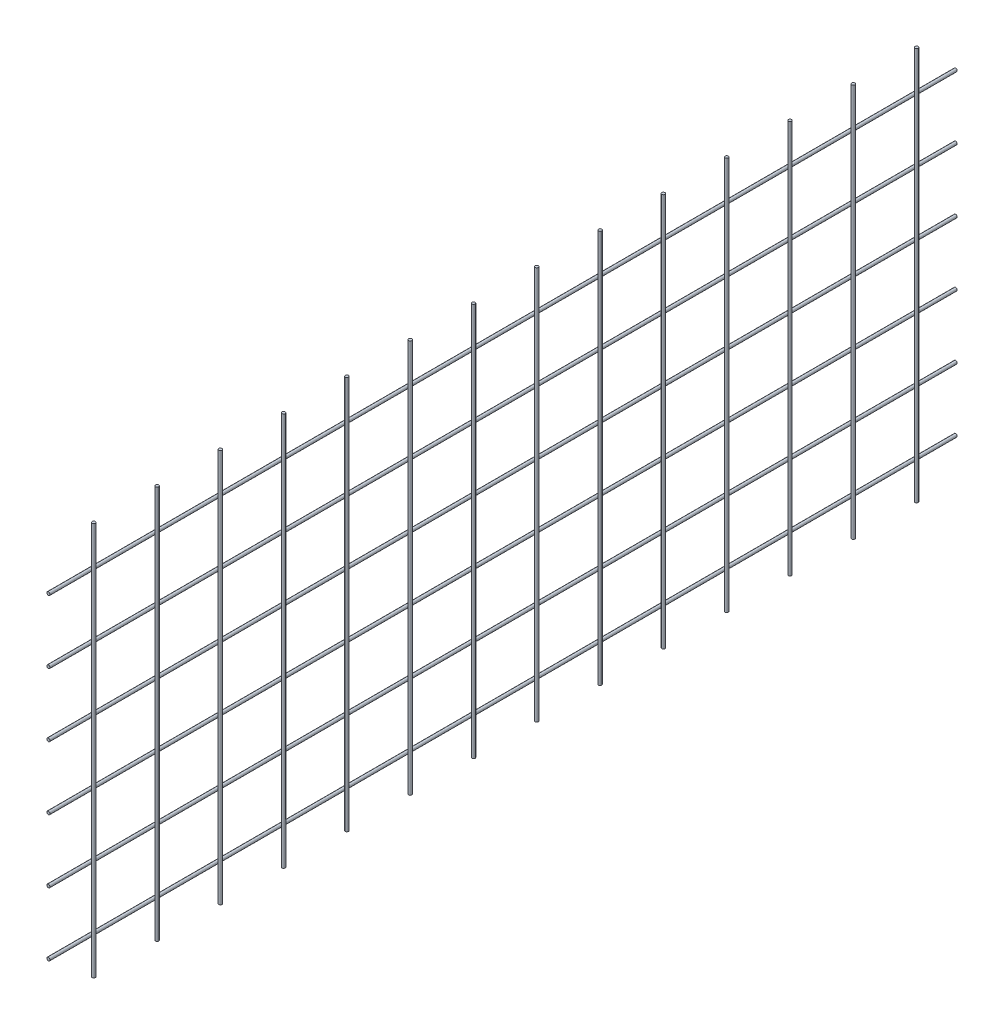
ISO-10303-21;
HEADER;
FILE_DESCRIPTION(('STEP AP214'),'2;1');
FILE_NAME('part.step','',(''),(''),'','','');
FILE_SCHEMA(('AUTOMOTIVE_DESIGN { 1 0 10303 214 1 1 1 1 }'));
ENDSEC;
DATA;
#1=APPLICATION_CONTEXT('core data for automotive mechanical design processes');
#2=APPLICATION_PROTOCOL_DEFINITION('international standard','automotive_design',2000,#1);
#3=PRODUCT_CONTEXT('',#1,'mechanical');
#4=PRODUCT('Part','Part','',(#3));
#5=PRODUCT_RELATED_PRODUCT_CATEGORY('part','',(#4));
#6=PRODUCT_DEFINITION_FORMATION('','',#4);
#7=PRODUCT_DEFINITION_CONTEXT('part definition',#1,'design');
#8=PRODUCT_DEFINITION('design','',#6,#7);
#9=PRODUCT_DEFINITION_SHAPE('','',#8);
#10=(LENGTH_UNIT() NAMED_UNIT(*) SI_UNIT(.MILLI.,.METRE.));
#11=(NAMED_UNIT(*) PLANE_ANGLE_UNIT() SI_UNIT($,.RADIAN.));
#12=(NAMED_UNIT(*) SI_UNIT($,.STERADIAN.) SOLID_ANGLE_UNIT());
#13=UNCERTAINTY_MEASURE_WITH_UNIT(LENGTH_MEASURE(1.E-05),#10,'distance_accuracy_value','');
#14=(GEOMETRIC_REPRESENTATION_CONTEXT(3) GLOBAL_UNCERTAINTY_ASSIGNED_CONTEXT((#13)) GLOBAL_UNIT_ASSIGNED_CONTEXT((#10,
#11,#12)) REPRESENTATION_CONTEXT('',''));
#15=CARTESIAN_POINT('',(0.,0.,0.));
#16=DIRECTION('',(0.,0.,1.));
#17=DIRECTION('',(1.,0.,0.));
#18=AXIS2_PLACEMENT_3D('',#15,#16,#17);
#19=CARTESIAN_POINT('',(3.00000000000011,1980.00200000001,-300.000000000003));
#20=DIRECTION('',(0.,-1.00000000000001,0.));
#21=DIRECTION('',(0.,0.,-1.));
#22=AXIS2_PLACEMENT_3D('',#19,#20,#21);
#23=CYLINDRICAL_SURFACE('',#22,1.5);
#24=CARTESIAN_POINT('',(3.00000000000034,1940.00000000001,-300.000000000003));
#25=DIRECTION('',(0.,1.00000000000001,0.));
#26=DIRECTION('',(0.,0.,1.));
#27=AXIS2_PLACEMENT_3D('',#24,#25,#26);
#28=CIRCLE('',#27,1.5);
#29=CARTESIAN_POINT('',(3.00000000000033,1940.00000000001,-298.500000000003));
#30=VERTEX_POINT('',#29);
#31=EDGE_CURVE('E11',#30,#30,#28,.T.);
#32=ORIENTED_EDGE('',*,*,#31,.F.);
#33=EDGE_LOOP('',(#32));
#34=FACE_BOUND('',#33,.T.);
#35=CARTESIAN_POINT('',(3.00000000000011,1567.00000000001,-300.000000000003));
#36=DIRECTION('',(0.,-1.00000000000001,0.));
#37=DIRECTION('',(0.,0.,-1.));
#38=AXIS2_PLACEMENT_3D('',#35,#36,#37);
#39=CIRCLE('',#38,1.5);
#40=CARTESIAN_POINT('',(3.00000000000011,1567.00000000001,-301.500000000003));
#41=VERTEX_POINT('',#40);
#42=EDGE_CURVE('E59',#41,#41,#39,.T.);
#43=ORIENTED_EDGE('',*,*,#42,.F.);
#44=EDGE_LOOP('',(#43));
#45=FACE_BOUND('',#44,.T.);
#46=ADVANCED_FACE('F56',(#34,#45),#23,.T.);
#47=CARTESIAN_POINT('',(-15.4999999999981,1940.00000000002,-3060.00000000001));
#48=DIRECTION('',(0.,1.00000000000001,0.));
#49=DIRECTION('',(0.,0.,1.));
#50=AXIS2_PLACEMENT_3D('',#47,#48,#49);
#51=PLANE('',#50);
#52=ORIENTED_EDGE('',*,*,#31,.T.);
#53=EDGE_LOOP('',(#52));
#54=FACE_BOUND('',#53,.T.);
#55=ADVANCED_FACE('F76',(#54),#51,.T.);
#56=CARTESIAN_POINT('',(-20.0099999999999,1567.00000000001,-20.0000000000029));
#57=DIRECTION('',(0.,-1.00000000000001,0.));
#58=DIRECTION('',(0.,0.,-1.));
#59=AXIS2_PLACEMENT_3D('',#56,#57,#58);
#60=PLANE('',#59);
#61=ORIENTED_EDGE('',*,*,#42,.T.);
#62=EDGE_LOOP('',(#61));
#63=FACE_BOUND('',#62,.T.);
#64=ADVANCED_FACE('F73',(#63),#60,.T.);
#65=CLOSED_SHELL('',(#46,#55,#64));
#66=MANIFOLD_SOLID_BREP('B2',#65);
#67=CARTESIAN_POINT('',(-1.77635683940025E-12,1600.00000000001,-20.0000000000029));
#68=DIRECTION('',(0.,0.,-1.));
#69=DIRECTION('',(-0.999999999999997,0.,0.));
#70=AXIS2_PLACEMENT_3D('',#67,#68,#69);
#71=PLANE('',#70);
#72=CARTESIAN_POINT('',(-1.77635683940025E-12,1600.00000000001,-20.0000000000029));
#73=DIRECTION('',(0.,0.,-1.));
#74=DIRECTION('',(-0.999999999999997,0.,0.));
#75=AXIS2_PLACEMENT_3D('',#72,#73,#74);
#76=CIRCLE('',#75,1.49999999999989);
#77=CARTESIAN_POINT('',(-1.50000000000166,1600.00000000001,-20.0000000000029));
#78=VERTEX_POINT('',#77);
#79=EDGE_CURVE('E55',#78,#78,#76,.T.);
#80=ORIENTED_EDGE('',*,*,#79,.F.);
#81=EDGE_LOOP('',(#80));
#82=FACE_BOUND('',#81,.T.);
#83=ADVANCED_FACE('F104',(#82),#71,.F.);
#84=CARTESIAN_POINT('',(-2.22044604925031E-13,1600.00000000002,-3080.00200000001));
#85=DIRECTION('',(0.,0.,1.));
#86=DIRECTION('',(0.999999999999997,0.,0.));
#87=AXIS2_PLACEMENT_3D('',#84,#85,#86);
#88=CYLINDRICAL_SURFACE('',#87,1.49999999999989);
#89=ORIENTED_EDGE('',*,*,#79,.T.);
#90=EDGE_LOOP('',(#89));
#91=FACE_BOUND('',#90,.T.);
#92=CARTESIAN_POINT('',(0.,1600.00000000001,-880.000000000004));
#93=DIRECTION('',(0.,0.,-1.));
#94=DIRECTION('',(-0.999999999999997,0.,0.));
#95=AXIS2_PLACEMENT_3D('',#92,#93,#94);
#96=CIRCLE('',#95,1.49999999999989);
#97=CARTESIAN_POINT('',(-1.49999999999988,1600.00000000001,-880.000000000004));
#98=VERTEX_POINT('',#97);
#99=EDGE_CURVE('E108',#98,#98,#96,.T.);
#100=ORIENTED_EDGE('',*,*,#99,.F.);
#101=EDGE_LOOP('',(#100));
#102=FACE_BOUND('',#101,.T.);
#103=ADVANCED_FACE('F106',(#91,#102),#88,.T.);
#104=CARTESIAN_POINT('',(-20.0099999999979,1940.00000000001,-880.000000000004));
#105=DIRECTION('',(0.,0.,-1.));
#106=DIRECTION('',(-0.999999999999997,0.,0.));
#107=AXIS2_PLACEMENT_3D('',#104,#105,#106);
#108=PLANE('',#107);
#109=ORIENTED_EDGE('',*,*,#99,.T.);
#110=EDGE_LOOP('',(#109));
#111=FACE_BOUND('',#110,.T.);
#112=ADVANCED_FACE('F121',(#111),#108,.T.);
#113=CLOSED_SHELL('',(#83,#103,#112));
#114=MANIFOLD_SOLID_BREP('B6',#113);
#115=CARTESIAN_POINT('',(-1.77635683940025E-12,1660.00000000001,-20.0000000000029));
#116=DIRECTION('',(0.,0.,-1.));
#117=DIRECTION('',(-0.999999999999997,0.,0.));
#118=AXIS2_PLACEMENT_3D('',#115,#116,#117);
#119=PLANE('',#118);
#120=CARTESIAN_POINT('',(-1.77635683940025E-12,1660.00000000001,-20.0000000000029));
#121=DIRECTION('',(0.,0.,-1.));
#122=DIRECTION('',(-0.999999999999997,0.,0.));
#123=AXIS2_PLACEMENT_3D('',#120,#121,#122);
#124=CIRCLE('',#123,1.49999999999989);
#125=CARTESIAN_POINT('',(-1.50000000000166,1660.00000000001,-20.0000000000029));
#126=VERTEX_POINT('',#125);
#127=EDGE_CURVE('E103',#126,#126,#124,.T.);
#128=ORIENTED_EDGE('',*,*,#127,.F.);
#129=EDGE_LOOP('',(#128));
#130=FACE_BOUND('',#129,.T.);
#131=ADVANCED_FACE('F151',(#130),#119,.F.);
#132=CARTESIAN_POINT('',(-2.22044604925031E-13,1660.00000000002,-3080.00200000001));
#133=DIRECTION('',(0.,0.,1.));
#134=DIRECTION('',(0.999999999999997,0.,0.));
#135=AXIS2_PLACEMENT_3D('',#132,#133,#134);
#136=CYLINDRICAL_SURFACE('',#135,1.49999999999989);
#137=ORIENTED_EDGE('',*,*,#127,.T.);
#138=EDGE_LOOP('',(#137));
#139=FACE_BOUND('',#138,.T.);
#140=CARTESIAN_POINT('',(0.,1660.00000000001,-880.000000000004));
#141=DIRECTION('',(0.,0.,-1.));
#142=DIRECTION('',(-0.999999999999997,0.,0.));
#143=AXIS2_PLACEMENT_3D('',#140,#141,#142);
#144=CIRCLE('',#143,1.49999999999989);
#145=CARTESIAN_POINT('',(-1.49999999999988,1660.00000000001,-880.000000000004));
#146=VERTEX_POINT('',#145);
#147=EDGE_CURVE('E155',#146,#146,#144,.T.);
#148=ORIENTED_EDGE('',*,*,#147,.F.);
#149=EDGE_LOOP('',(#148));
#150=FACE_BOUND('',#149,.T.);
#151=ADVANCED_FACE('F153',(#139,#150),#136,.T.);
#152=CARTESIAN_POINT('',(-20.0099999999979,1940.00000000001,-880.000000000004));
#153=DIRECTION('',(0.,0.,-1.));
#154=DIRECTION('',(-0.999999999999997,0.,0.));
#155=AXIS2_PLACEMENT_3D('',#152,#153,#154);
#156=PLANE('',#155);
#157=ORIENTED_EDGE('',*,*,#147,.T.);
#158=EDGE_LOOP('',(#157));
#159=FACE_BOUND('',#158,.T.);
#160=ADVANCED_FACE('F168',(#159),#156,.T.);
#161=CLOSED_SHELL('',(#131,#151,#160));
#162=MANIFOLD_SOLID_BREP('B50',#161);
#163=CARTESIAN_POINT('',(2.22044604925031E-13,1720.00000000001,-20.0000000000029));
#164=DIRECTION('',(0.,0.,-1.));
#165=DIRECTION('',(-0.999999999999997,0.,0.));
#166=AXIS2_PLACEMENT_3D('',#163,#164,#165);
#167=PLANE('',#166);
#168=CARTESIAN_POINT('',(2.22044604925031E-13,1720.00000000001,-20.0000000000029));
#169=DIRECTION('',(0.,0.,-1.));
#170=DIRECTION('',(-0.999999999999997,0.,0.));
#171=AXIS2_PLACEMENT_3D('',#168,#169,#170);
#172=CIRCLE('',#171,1.49999999999989);
#173=CARTESIAN_POINT('',(-1.49999999999966,1720.00000000001,-20.0000000000029));
#174=VERTEX_POINT('',#173);
#175=EDGE_CURVE('E150',#174,#174,#172,.T.);
#176=ORIENTED_EDGE('',*,*,#175,.F.);
#177=EDGE_LOOP('',(#176));
#178=FACE_BOUND('',#177,.T.);
#179=ADVANCED_FACE('F198',(#178),#167,.F.);
#180=CARTESIAN_POINT('',(-2.22044604925031E-13,1720.00000000002,-3080.00200000001));
#181=DIRECTION('',(0.,0.,1.));
#182=DIRECTION('',(0.999999999999997,0.,0.));
#183=AXIS2_PLACEMENT_3D('',#180,#181,#182);
#184=CYLINDRICAL_SURFACE('',#183,1.49999999999989);
#185=ORIENTED_EDGE('',*,*,#175,.T.);
#186=EDGE_LOOP('',(#185));
#187=FACE_BOUND('',#186,.T.);
#188=CARTESIAN_POINT('',(0.,1720.00000000001,-880.000000000004));
#189=DIRECTION('',(0.,0.,-1.));
#190=DIRECTION('',(-0.999999999999997,0.,0.));
#191=AXIS2_PLACEMENT_3D('',#188,#189,#190);
#192=CIRCLE('',#191,1.49999999999989);
#193=CARTESIAN_POINT('',(-1.49999999999988,1720.00000000001,-880.000000000004));
#194=VERTEX_POINT('',#193);
#195=EDGE_CURVE('E202',#194,#194,#192,.T.);
#196=ORIENTED_EDGE('',*,*,#195,.F.);
#197=EDGE_LOOP('',(#196));
#198=FACE_BOUND('',#197,.T.);
#199=ADVANCED_FACE('F200',(#187,#198),#184,.T.);
#200=CARTESIAN_POINT('',(-20.0099999999979,1940.00000000001,-880.000000000004));
#201=DIRECTION('',(0.,0.,-1.));
#202=DIRECTION('',(-0.999999999999997,0.,0.));
#203=AXIS2_PLACEMENT_3D('',#200,#201,#202);
#204=PLANE('',#203);
#205=ORIENTED_EDGE('',*,*,#195,.T.);
#206=EDGE_LOOP('',(#205));
#207=FACE_BOUND('',#206,.T.);
#208=ADVANCED_FACE('F215',(#207),#204,.T.);
#209=CLOSED_SHELL('',(#179,#199,#208));
#210=MANIFOLD_SOLID_BREP('B98',#209);
#211=CARTESIAN_POINT('',(2.22044604925031E-13,1780.00000000001,-20.0000000000029));
#212=DIRECTION('',(0.,0.,-1.));
#213=DIRECTION('',(-0.999999999999997,0.,0.));
#214=AXIS2_PLACEMENT_3D('',#211,#212,#213);
#215=PLANE('',#214);
#216=CARTESIAN_POINT('',(2.22044604925031E-13,1780.00000000001,-20.0000000000029));
#217=DIRECTION('',(0.,0.,-1.));
#218=DIRECTION('',(-0.999999999999997,0.,0.));
#219=AXIS2_PLACEMENT_3D('',#216,#217,#218);
#220=CIRCLE('',#219,1.49999999999989);
#221=CARTESIAN_POINT('',(-1.49999999999966,1780.00000000001,-20.0000000000029));
#222=VERTEX_POINT('',#221);
#223=EDGE_CURVE('E197',#222,#222,#220,.T.);
#224=ORIENTED_EDGE('',*,*,#223,.F.);
#225=EDGE_LOOP('',(#224));
#226=FACE_BOUND('',#225,.T.);
#227=ADVANCED_FACE('F245',(#226),#215,.F.);
#228=CARTESIAN_POINT('',(-2.22044604925031E-13,1780.00000000002,-3080.00200000001));
#229=DIRECTION('',(0.,0.,1.));
#230=DIRECTION('',(0.999999999999997,0.,0.));
#231=AXIS2_PLACEMENT_3D('',#228,#229,#230);
#232=CYLINDRICAL_SURFACE('',#231,1.49999999999989);
#233=ORIENTED_EDGE('',*,*,#223,.T.);
#234=EDGE_LOOP('',(#233));
#235=FACE_BOUND('',#234,.T.);
#236=CARTESIAN_POINT('',(0.,1780.00000000001,-880.000000000004));
#237=DIRECTION('',(0.,0.,-1.));
#238=DIRECTION('',(-0.999999999999997,0.,0.));
#239=AXIS2_PLACEMENT_3D('',#236,#237,#238);
#240=CIRCLE('',#239,1.49999999999989);
#241=CARTESIAN_POINT('',(-1.49999999999988,1780.00000000001,-880.000000000004));
#242=VERTEX_POINT('',#241);
#243=EDGE_CURVE('E249',#242,#242,#240,.T.);
#244=ORIENTED_EDGE('',*,*,#243,.F.);
#245=EDGE_LOOP('',(#244));
#246=FACE_BOUND('',#245,.T.);
#247=ADVANCED_FACE('F247',(#235,#246),#232,.T.);
#248=CARTESIAN_POINT('',(-20.0099999999979,1940.00000000001,-880.000000000004));
#249=DIRECTION('',(0.,0.,-1.));
#250=DIRECTION('',(-0.999999999999997,0.,0.));
#251=AXIS2_PLACEMENT_3D('',#248,#249,#250);
#252=PLANE('',#251);
#253=ORIENTED_EDGE('',*,*,#243,.T.);
#254=EDGE_LOOP('',(#253));
#255=FACE_BOUND('',#254,.T.);
#256=ADVANCED_FACE('F262',(#255),#252,.T.);
#257=CLOSED_SHELL('',(#227,#247,#256));
#258=MANIFOLD_SOLID_BREP('B145',#257);
#259=CARTESIAN_POINT('',(2.22044604925031E-13,1840.00000000001,-20.0000000000031));
#260=DIRECTION('',(0.,0.,-1.));
#261=DIRECTION('',(-0.999999999999997,0.,0.));
#262=AXIS2_PLACEMENT_3D('',#259,#260,#261);
#263=PLANE('',#262);
#264=CARTESIAN_POINT('',(2.22044604925031E-13,1840.00000000001,-20.0000000000031));
#265=DIRECTION('',(0.,0.,-1.));
#266=DIRECTION('',(-0.999999999999997,0.,0.));
#267=AXIS2_PLACEMENT_3D('',#264,#265,#266);
#268=CIRCLE('',#267,1.49999999999989);
#269=CARTESIAN_POINT('',(-1.49999999999966,1840.00000000001,-20.0000000000031));
#270=VERTEX_POINT('',#269);
#271=EDGE_CURVE('E244',#270,#270,#268,.T.);
#272=ORIENTED_EDGE('',*,*,#271,.F.);
#273=EDGE_LOOP('',(#272));
#274=FACE_BOUND('',#273,.T.);
#275=ADVANCED_FACE('F292',(#274),#263,.F.);
#276=CARTESIAN_POINT('',(-2.22044604925031E-13,1840.00000000002,-3080.00200000001));
#277=DIRECTION('',(0.,0.,1.));
#278=DIRECTION('',(0.999999999999997,0.,0.));
#279=AXIS2_PLACEMENT_3D('',#276,#277,#278);
#280=CYLINDRICAL_SURFACE('',#279,1.49999999999989);
#281=ORIENTED_EDGE('',*,*,#271,.T.);
#282=EDGE_LOOP('',(#281));
#283=FACE_BOUND('',#282,.T.);
#284=CARTESIAN_POINT('',(2.22044604925031E-13,1840.00000000001,-880.000000000004));
#285=DIRECTION('',(0.,0.,-1.));
#286=DIRECTION('',(-0.999999999999997,0.,0.));
#287=AXIS2_PLACEMENT_3D('',#284,#285,#286);
#288=CIRCLE('',#287,1.49999999999989);
#289=CARTESIAN_POINT('',(-1.49999999999966,1840.00000000001,-880.000000000004));
#290=VERTEX_POINT('',#289);
#291=EDGE_CURVE('E296',#290,#290,#288,.T.);
#292=ORIENTED_EDGE('',*,*,#291,.F.);
#293=EDGE_LOOP('',(#292));
#294=FACE_BOUND('',#293,.T.);
#295=ADVANCED_FACE('F294',(#283,#294),#280,.T.);
#296=CARTESIAN_POINT('',(-20.0099999999979,1940.00000000001,-880.000000000004));
#297=DIRECTION('',(0.,0.,-1.));
#298=DIRECTION('',(-0.999999999999997,0.,0.));
#299=AXIS2_PLACEMENT_3D('',#296,#297,#298);
#300=PLANE('',#299);
#301=ORIENTED_EDGE('',*,*,#291,.T.);
#302=EDGE_LOOP('',(#301));
#303=FACE_BOUND('',#302,.T.);
#304=ADVANCED_FACE('F309',(#303),#300,.T.);
#305=CLOSED_SHELL('',(#275,#295,#304));
#306=MANIFOLD_SOLID_BREP('B192',#305);
#307=CARTESIAN_POINT('',(2.22044604925031E-13,1900.00000000001,-20.0000000000031));
#308=DIRECTION('',(0.,0.,-1.));
#309=DIRECTION('',(-0.999999999999997,0.,0.));
#310=AXIS2_PLACEMENT_3D('',#307,#308,#309);
#311=PLANE('',#310);
#312=CARTESIAN_POINT('',(2.22044604925031E-13,1900.00000000001,-20.0000000000031));
#313=DIRECTION('',(0.,0.,-1.));
#314=DIRECTION('',(-0.999999999999997,0.,0.));
#315=AXIS2_PLACEMENT_3D('',#312,#313,#314);
#316=CIRCLE('',#315,1.49999999999989);
#317=CARTESIAN_POINT('',(-1.49999999999966,1900.00000000001,-20.0000000000031));
#318=VERTEX_POINT('',#317);
#319=EDGE_CURVE('E291',#318,#318,#316,.T.);
#320=ORIENTED_EDGE('',*,*,#319,.F.);
#321=EDGE_LOOP('',(#320));
#322=FACE_BOUND('',#321,.T.);
#323=ADVANCED_FACE('F339',(#322),#311,.F.);
#324=CARTESIAN_POINT('',(-2.22044604925031E-13,1900.00000000002,-3080.00200000001));
#325=DIRECTION('',(0.,0.,1.));
#326=DIRECTION('',(0.999999999999997,0.,0.));
#327=AXIS2_PLACEMENT_3D('',#324,#325,#326);
#328=CYLINDRICAL_SURFACE('',#327,1.49999999999989);
#329=ORIENTED_EDGE('',*,*,#319,.T.);
#330=EDGE_LOOP('',(#329));
#331=FACE_BOUND('',#330,.T.);
#332=CARTESIAN_POINT('',(2.22044604925031E-13,1900.00000000001,-880.000000000004));
#333=DIRECTION('',(0.,0.,-1.));
#334=DIRECTION('',(-0.999999999999997,0.,0.));
#335=AXIS2_PLACEMENT_3D('',#332,#333,#334);
#336=CIRCLE('',#335,1.49999999999989);
#337=CARTESIAN_POINT('',(-1.49999999999966,1900.00000000001,-880.000000000004));
#338=VERTEX_POINT('',#337);
#339=EDGE_CURVE('E343',#338,#338,#336,.T.);
#340=ORIENTED_EDGE('',*,*,#339,.F.);
#341=EDGE_LOOP('',(#340));
#342=FACE_BOUND('',#341,.T.);
#343=ADVANCED_FACE('F341',(#331,#342),#328,.T.);
#344=CARTESIAN_POINT('',(-20.0099999999979,1940.00000000001,-880.000000000004));
#345=DIRECTION('',(0.,0.,-1.));
#346=DIRECTION('',(-0.999999999999997,0.,0.));
#347=AXIS2_PLACEMENT_3D('',#344,#345,#346);
#348=PLANE('',#347);
#349=ORIENTED_EDGE('',*,*,#339,.T.);
#350=EDGE_LOOP('',(#349));
#351=FACE_BOUND('',#350,.T.);
#352=ADVANCED_FACE('F356',(#351),#348,.T.);
#353=CLOSED_SHELL('',(#323,#343,#352));
#354=MANIFOLD_SOLID_BREP('B239',#353);
#355=CARTESIAN_POINT('',(3.00000000000011,1980.00200000001,-840.000000000005));
#356=DIRECTION('',(0.,-1.00000000000001,0.));
#357=DIRECTION('',(0.,0.,-1.));
#358=AXIS2_PLACEMENT_3D('',#355,#356,#357);
#359=CYLINDRICAL_SURFACE('',#358,1.5);
#360=CARTESIAN_POINT('',(3.00000000000011,1940.00000000001,-840.000000000005));
#361=DIRECTION('',(0.,1.00000000000001,0.));
#362=DIRECTION('',(0.,0.,1.));
#363=AXIS2_PLACEMENT_3D('',#360,#361,#362);
#364=CIRCLE('',#363,1.5);
#365=CARTESIAN_POINT('',(3.00000000000011,1940.00000000001,-838.500000000005));
#366=VERTEX_POINT('',#365);
#367=EDGE_CURVE('E338',#366,#366,#364,.T.);
#368=ORIENTED_EDGE('',*,*,#367,.F.);
#369=EDGE_LOOP('',(#368));
#370=FACE_BOUND('',#369,.T.);
#371=CARTESIAN_POINT('',(2.99999999999989,1567.00000000001,-840.000000000004));
#372=DIRECTION('',(0.,-1.00000000000001,0.));
#373=DIRECTION('',(0.,0.,-1.));
#374=AXIS2_PLACEMENT_3D('',#371,#372,#373);
#375=CIRCLE('',#374,1.5);
#376=CARTESIAN_POINT('',(2.99999999999989,1567.00000000001,-841.500000000004));
#377=VERTEX_POINT('',#376);
#378=EDGE_CURVE('E389',#377,#377,#375,.T.);
#379=ORIENTED_EDGE('',*,*,#378,.F.);
#380=EDGE_LOOP('',(#379));
#381=FACE_BOUND('',#380,.T.);
#382=ADVANCED_FACE('F386',(#370,#381),#359,.T.);
#383=CARTESIAN_POINT('',(-15.4999999999981,1940.00000000002,-3060.00000000001));
#384=DIRECTION('',(0.,1.00000000000001,0.));
#385=DIRECTION('',(0.,0.,1.));
#386=AXIS2_PLACEMENT_3D('',#383,#384,#385);
#387=PLANE('',#386);
#388=ORIENTED_EDGE('',*,*,#367,.T.);
#389=EDGE_LOOP('',(#388));
#390=FACE_BOUND('',#389,.T.);
#391=ADVANCED_FACE('F405',(#390),#387,.T.);
#392=CARTESIAN_POINT('',(-20.0099999999999,1567.00000000001,-20.0000000000029));
#393=DIRECTION('',(0.,-1.00000000000001,0.));
#394=DIRECTION('',(0.,0.,-1.));
#395=AXIS2_PLACEMENT_3D('',#392,#393,#394);
#396=PLANE('',#395);
#397=ORIENTED_EDGE('',*,*,#378,.T.);
#398=EDGE_LOOP('',(#397));
#399=FACE_BOUND('',#398,.T.);
#400=ADVANCED_FACE('F402',(#399),#396,.T.);
#401=CLOSED_SHELL('',(#382,#391,#400));
#402=MANIFOLD_SOLID_BREP('B286',#401);
#403=CARTESIAN_POINT('',(3.00000000000034,1980.00200000001,-780.000000000005));
#404=DIRECTION('',(0.,-1.00000000000001,0.));
#405=DIRECTION('',(0.,0.,-1.));
#406=AXIS2_PLACEMENT_3D('',#403,#404,#405);
#407=CYLINDRICAL_SURFACE('',#406,1.5);
#408=CARTESIAN_POINT('',(3.00000000000233,1940.00000000001,-780.000000000005));
#409=DIRECTION('',(0.,1.00000000000001,0.));
#410=DIRECTION('',(0.,0.,1.));
#411=AXIS2_PLACEMENT_3D('',#408,#409,#410);
#412=CIRCLE('',#411,1.5);
#413=CARTESIAN_POINT('',(3.00000000000233,1940.00000000001,-778.500000000005));
#414=VERTEX_POINT('',#413);
#415=EDGE_CURVE('E385',#414,#414,#412,.T.);
#416=ORIENTED_EDGE('',*,*,#415,.F.);
#417=EDGE_LOOP('',(#416));
#418=FACE_BOUND('',#417,.T.);
#419=CARTESIAN_POINT('',(3.00000000000034,1567.00000000001,-780.000000000004));
#420=DIRECTION('',(0.,-1.00000000000001,0.));
#421=DIRECTION('',(0.,0.,-1.));
#422=AXIS2_PLACEMENT_3D('',#419,#420,#421);
#423=CIRCLE('',#422,1.5);
#424=CARTESIAN_POINT('',(3.00000000000034,1567.00000000001,-781.500000000004));
#425=VERTEX_POINT('',#424);
#426=EDGE_CURVE('E436',#425,#425,#423,.T.);
#427=ORIENTED_EDGE('',*,*,#426,.F.);
#428=EDGE_LOOP('',(#427));
#429=FACE_BOUND('',#428,.T.);
#430=ADVANCED_FACE('F433',(#418,#429),#407,.T.);
#431=CARTESIAN_POINT('',(-15.4999999999981,1940.00000000002,-3060.00000000001));
#432=DIRECTION('',(0.,1.00000000000001,0.));
#433=DIRECTION('',(0.,0.,1.));
#434=AXIS2_PLACEMENT_3D('',#431,#432,#433);
#435=PLANE('',#434);
#436=ORIENTED_EDGE('',*,*,#415,.T.);
#437=EDGE_LOOP('',(#436));
#438=FACE_BOUND('',#437,.T.);
#439=ADVANCED_FACE('F452',(#438),#435,.T.);
#440=CARTESIAN_POINT('',(-20.0099999999999,1567.00000000001,-20.0000000000029));
#441=DIRECTION('',(0.,-1.00000000000001,0.));
#442=DIRECTION('',(0.,0.,-1.));
#443=AXIS2_PLACEMENT_3D('',#440,#441,#442);
#444=PLANE('',#443);
#445=ORIENTED_EDGE('',*,*,#426,.T.);
#446=EDGE_LOOP('',(#445));
#447=FACE_BOUND('',#446,.T.);
#448=ADVANCED_FACE('F449',(#447),#444,.T.);
#449=CLOSED_SHELL('',(#430,#439,#448));
#450=MANIFOLD_SOLID_BREP('B333',#449);
#451=CARTESIAN_POINT('',(3.00000000000011,1980.00200000001,-720.000000000005));
#452=DIRECTION('',(0.,-1.00000000000001,0.));
#453=DIRECTION('',(0.,0.,-1.));
#454=AXIS2_PLACEMENT_3D('',#451,#452,#453);
#455=CYLINDRICAL_SURFACE('',#454,1.5);
#456=CARTESIAN_POINT('',(3.00000000000034,1940.00000000001,-720.000000000005));
#457=DIRECTION('',(0.,1.00000000000001,0.));
#458=DIRECTION('',(0.,0.,1.));
#459=AXIS2_PLACEMENT_3D('',#456,#457,#458);
#460=CIRCLE('',#459,1.5);
#461=CARTESIAN_POINT('',(3.00000000000033,1940.00000000001,-718.500000000005));
#462=VERTEX_POINT('',#461);
#463=EDGE_CURVE('E432',#462,#462,#460,.T.);
#464=ORIENTED_EDGE('',*,*,#463,.F.);
#465=EDGE_LOOP('',(#464));
#466=FACE_BOUND('',#465,.T.);
#467=CARTESIAN_POINT('',(3.00000000000011,1567.00000000001,-720.000000000004));
#468=DIRECTION('',(0.,-1.00000000000001,0.));
#469=DIRECTION('',(0.,0.,-1.));
#470=AXIS2_PLACEMENT_3D('',#467,#468,#469);
#471=CIRCLE('',#470,1.5);
#472=CARTESIAN_POINT('',(3.00000000000011,1567.00000000001,-721.500000000004));
#473=VERTEX_POINT('',#472);
#474=EDGE_CURVE('E483',#473,#473,#471,.T.);
#475=ORIENTED_EDGE('',*,*,#474,.F.);
#476=EDGE_LOOP('',(#475));
#477=FACE_BOUND('',#476,.T.);
#478=ADVANCED_FACE('F480',(#466,#477),#455,.T.);
#479=CARTESIAN_POINT('',(-15.4999999999981,1940.00000000002,-3060.00000000001));
#480=DIRECTION('',(0.,1.00000000000001,0.));
#481=DIRECTION('',(0.,0.,1.));
#482=AXIS2_PLACEMENT_3D('',#479,#480,#481);
#483=PLANE('',#482);
#484=ORIENTED_EDGE('',*,*,#463,.T.);
#485=EDGE_LOOP('',(#484));
#486=FACE_BOUND('',#485,.T.);
#487=ADVANCED_FACE('F499',(#486),#483,.T.);
#488=CARTESIAN_POINT('',(-20.0099999999999,1567.00000000001,-20.0000000000029));
#489=DIRECTION('',(0.,-1.00000000000001,0.));
#490=DIRECTION('',(0.,0.,-1.));
#491=AXIS2_PLACEMENT_3D('',#488,#489,#490);
#492=PLANE('',#491);
#493=ORIENTED_EDGE('',*,*,#474,.T.);
#494=EDGE_LOOP('',(#493));
#495=FACE_BOUND('',#494,.T.);
#496=ADVANCED_FACE('F496',(#495),#492,.T.);
#497=CLOSED_SHELL('',(#478,#487,#496));
#498=MANIFOLD_SOLID_BREP('B380',#497);
#499=CARTESIAN_POINT('',(3.00000000000011,1980.00200000001,-660.000000000005));
#500=DIRECTION('',(0.,-1.00000000000001,0.));
#501=DIRECTION('',(0.,0.,-1.));
#502=AXIS2_PLACEMENT_3D('',#499,#500,#501);
#503=CYLINDRICAL_SURFACE('',#502,1.5);
#504=CARTESIAN_POINT('',(3.00000000000011,1940.00000000001,-660.000000000005));
#505=DIRECTION('',(0.,1.00000000000001,0.));
#506=DIRECTION('',(0.,0.,1.));
#507=AXIS2_PLACEMENT_3D('',#504,#505,#506);
#508=CIRCLE('',#507,1.5);
#509=CARTESIAN_POINT('',(3.00000000000011,1940.00000000001,-658.500000000005));
#510=VERTEX_POINT('',#509);
#511=EDGE_CURVE('E479',#510,#510,#508,.T.);
#512=ORIENTED_EDGE('',*,*,#511,.F.);
#513=EDGE_LOOP('',(#512));
#514=FACE_BOUND('',#513,.T.);
#515=CARTESIAN_POINT('',(2.99999999999989,1567.00000000001,-660.000000000004));
#516=DIRECTION('',(0.,-1.00000000000001,0.));
#517=DIRECTION('',(0.,0.,-1.));
#518=AXIS2_PLACEMENT_3D('',#515,#516,#517);
#519=CIRCLE('',#518,1.5);
#520=CARTESIAN_POINT('',(2.99999999999989,1567.00000000001,-661.500000000004));
#521=VERTEX_POINT('',#520);
#522=EDGE_CURVE('E530',#521,#521,#519,.T.);
#523=ORIENTED_EDGE('',*,*,#522,.F.);
#524=EDGE_LOOP('',(#523));
#525=FACE_BOUND('',#524,.T.);
#526=ADVANCED_FACE('F527',(#514,#525),#503,.T.);
#527=CARTESIAN_POINT('',(-15.4999999999981,1940.00000000002,-3060.00000000001));
#528=DIRECTION('',(0.,1.00000000000001,0.));
#529=DIRECTION('',(0.,0.,1.));
#530=AXIS2_PLACEMENT_3D('',#527,#528,#529);
#531=PLANE('',#530);
#532=ORIENTED_EDGE('',*,*,#511,.T.);
#533=EDGE_LOOP('',(#532));
#534=FACE_BOUND('',#533,.T.);
#535=ADVANCED_FACE('F546',(#534),#531,.T.);
#536=CARTESIAN_POINT('',(-20.0099999999999,1567.00000000001,-20.0000000000029));
#537=DIRECTION('',(0.,-1.00000000000001,0.));
#538=DIRECTION('',(0.,0.,-1.));
#539=AXIS2_PLACEMENT_3D('',#536,#537,#538);
#540=PLANE('',#539);
#541=ORIENTED_EDGE('',*,*,#522,.T.);
#542=EDGE_LOOP('',(#541));
#543=FACE_BOUND('',#542,.T.);
#544=ADVANCED_FACE('F543',(#543),#540,.T.);
#545=CLOSED_SHELL('',(#526,#535,#544));
#546=MANIFOLD_SOLID_BREP('B427',#545);
#547=CARTESIAN_POINT('',(3.00000000000034,1980.00200000001,-600.000000000005));
#548=DIRECTION('',(0.,-1.00000000000001,0.));
#549=DIRECTION('',(0.,0.,-1.));
#550=AXIS2_PLACEMENT_3D('',#547,#548,#549);
#551=CYLINDRICAL_SURFACE('',#550,1.5);
#552=CARTESIAN_POINT('',(3.00000000000233,1940.00000000001,-600.000000000005));
#553=DIRECTION('',(0.,1.00000000000001,0.));
#554=DIRECTION('',(0.,0.,1.));
#555=AXIS2_PLACEMENT_3D('',#552,#553,#554);
#556=CIRCLE('',#555,1.5);
#557=CARTESIAN_POINT('',(3.00000000000233,1940.00000000001,-598.500000000005));
#558=VERTEX_POINT('',#557);
#559=EDGE_CURVE('E526',#558,#558,#556,.T.);
#560=ORIENTED_EDGE('',*,*,#559,.F.);
#561=EDGE_LOOP('',(#560));
#562=FACE_BOUND('',#561,.T.);
#563=CARTESIAN_POINT('',(3.00000000000034,1567.00000000001,-600.000000000004));
#564=DIRECTION('',(0.,-1.00000000000001,0.));
#565=DIRECTION('',(0.,0.,-1.));
#566=AXIS2_PLACEMENT_3D('',#563,#564,#565);
#567=CIRCLE('',#566,1.5);
#568=CARTESIAN_POINT('',(3.00000000000034,1567.00000000001,-601.500000000004));
#569=VERTEX_POINT('',#568);
#570=EDGE_CURVE('E577',#569,#569,#567,.T.);
#571=ORIENTED_EDGE('',*,*,#570,.F.);
#572=EDGE_LOOP('',(#571));
#573=FACE_BOUND('',#572,.T.);
#574=ADVANCED_FACE('F574',(#562,#573),#551,.T.);
#575=CARTESIAN_POINT('',(-15.4999999999981,1940.00000000002,-3060.00000000001));
#576=DIRECTION('',(0.,1.00000000000001,0.));
#577=DIRECTION('',(0.,0.,1.));
#578=AXIS2_PLACEMENT_3D('',#575,#576,#577);
#579=PLANE('',#578);
#580=ORIENTED_EDGE('',*,*,#559,.T.);
#581=EDGE_LOOP('',(#580));
#582=FACE_BOUND('',#581,.T.);
#583=ADVANCED_FACE('F594',(#582),#579,.T.);
#584=CARTESIAN_POINT('',(-20.0099999999999,1567.00000000001,-20.0000000000029));
#585=DIRECTION('',(0.,-1.00000000000001,0.));
#586=DIRECTION('',(0.,0.,-1.));
#587=AXIS2_PLACEMENT_3D('',#584,#585,#586);
#588=PLANE('',#587);
#589=ORIENTED_EDGE('',*,*,#570,.T.);
#590=EDGE_LOOP('',(#589));
#591=FACE_BOUND('',#590,.T.);
#592=ADVANCED_FACE('F591',(#591),#588,.T.);
#593=CLOSED_SHELL('',(#574,#583,#592));
#594=MANIFOLD_SOLID_BREP('B474',#593);
#595=CARTESIAN_POINT('',(3.00000000000034,1980.00200000001,-540.000000000005));
#596=DIRECTION('',(0.,-1.00000000000001,0.));
#597=DIRECTION('',(0.,0.,-1.));
#598=AXIS2_PLACEMENT_3D('',#595,#596,#597);
#599=CYLINDRICAL_SURFACE('',#598,1.5);
#600=CARTESIAN_POINT('',(3.00000000000034,1940.00000000001,-540.000000000005));
#601=DIRECTION('',(0.,1.00000000000001,0.));
#602=DIRECTION('',(0.,0.,1.));
#603=AXIS2_PLACEMENT_3D('',#600,#601,#602);
#604=CIRCLE('',#603,1.5);
#605=CARTESIAN_POINT('',(3.00000000000033,1940.00000000001,-538.500000000005));
#606=VERTEX_POINT('',#605);
#607=EDGE_CURVE('E573',#606,#606,#604,.T.);
#608=ORIENTED_EDGE('',*,*,#607,.F.);
#609=EDGE_LOOP('',(#608));
#610=FACE_BOUND('',#609,.T.);
#611=CARTESIAN_POINT('',(3.00000000000011,1567.00000000001,-540.000000000004));
#612=DIRECTION('',(0.,-1.00000000000001,0.));
#613=DIRECTION('',(0.,0.,-1.));
#614=AXIS2_PLACEMENT_3D('',#611,#612,#613);
#615=CIRCLE('',#614,1.5);
#616=CARTESIAN_POINT('',(3.00000000000011,1567.00000000001,-541.500000000004));
#617=VERTEX_POINT('',#616);
#618=EDGE_CURVE('E625',#617,#617,#615,.T.);
#619=ORIENTED_EDGE('',*,*,#618,.F.);
#620=EDGE_LOOP('',(#619));
#621=FACE_BOUND('',#620,.T.);
#622=ADVANCED_FACE('F622',(#610,#621),#599,.T.);
#623=CARTESIAN_POINT('',(-15.4999999999981,1940.00000000002,-3060.00000000001));
#624=DIRECTION('',(0.,1.00000000000001,0.));
#625=DIRECTION('',(0.,0.,1.));
#626=AXIS2_PLACEMENT_3D('',#623,#624,#625);
#627=PLANE('',#626);
#628=ORIENTED_EDGE('',*,*,#607,.T.);
#629=EDGE_LOOP('',(#628));
#630=FACE_BOUND('',#629,.T.);
#631=ADVANCED_FACE('F642',(#630),#627,.T.);
#632=CARTESIAN_POINT('',(-20.0099999999999,1567.00000000001,-20.0000000000029));
#633=DIRECTION('',(0.,-1.00000000000001,0.));
#634=DIRECTION('',(0.,0.,-1.));
#635=AXIS2_PLACEMENT_3D('',#632,#633,#634);
#636=PLANE('',#635);
#637=ORIENTED_EDGE('',*,*,#618,.T.);
#638=EDGE_LOOP('',(#637));
#639=FACE_BOUND('',#638,.T.);
#640=ADVANCED_FACE('F639',(#639),#636,.T.);
#641=CLOSED_SHELL('',(#622,#631,#640));
#642=MANIFOLD_SOLID_BREP('B521',#641);
#643=CARTESIAN_POINT('',(3.00000000000011,1980.00200000001,-480.000000000003));
#644=DIRECTION('',(0.,-1.00000000000001,0.));
#645=DIRECTION('',(0.,0.,-1.));
#646=AXIS2_PLACEMENT_3D('',#643,#644,#645);
#647=CYLINDRICAL_SURFACE('',#646,1.5);
#648=CARTESIAN_POINT('',(3.00000000000034,1940.00000000001,-480.000000000003));
#649=DIRECTION('',(0.,1.00000000000001,0.));
#650=DIRECTION('',(0.,0.,1.));
#651=AXIS2_PLACEMENT_3D('',#648,#649,#650);
#652=CIRCLE('',#651,1.5);
#653=CARTESIAN_POINT('',(3.00000000000033,1940.00000000001,-478.500000000003));
#654=VERTEX_POINT('',#653);
#655=EDGE_CURVE('E621',#654,#654,#652,.T.);
#656=ORIENTED_EDGE('',*,*,#655,.F.);
#657=EDGE_LOOP('',(#656));
#658=FACE_BOUND('',#657,.T.);
#659=CARTESIAN_POINT('',(2.99999999999989,1567.00000000001,-480.000000000003));
#660=DIRECTION('',(0.,-1.00000000000001,0.));
#661=DIRECTION('',(0.,0.,-1.));
#662=AXIS2_PLACEMENT_3D('',#659,#660,#661);
#663=CIRCLE('',#662,1.5);
#664=CARTESIAN_POINT('',(2.99999999999989,1567.00000000001,-481.500000000003));
#665=VERTEX_POINT('',#664);
#666=EDGE_CURVE('E673',#665,#665,#663,.T.);
#667=ORIENTED_EDGE('',*,*,#666,.F.);
#668=EDGE_LOOP('',(#667));
#669=FACE_BOUND('',#668,.T.);
#670=ADVANCED_FACE('F670',(#658,#669),#647,.T.);
#671=CARTESIAN_POINT('',(-15.4999999999981,1940.00000000002,-3060.00000000001));
#672=DIRECTION('',(0.,1.00000000000001,0.));
#673=DIRECTION('',(0.,0.,1.));
#674=AXIS2_PLACEMENT_3D('',#671,#672,#673);
#675=PLANE('',#674);
#676=ORIENTED_EDGE('',*,*,#655,.T.);
#677=EDGE_LOOP('',(#676));
#678=FACE_BOUND('',#677,.T.);
#679=ADVANCED_FACE('F690',(#678),#675,.T.);
#680=CARTESIAN_POINT('',(-20.0099999999999,1567.00000000001,-20.0000000000029));
#681=DIRECTION('',(0.,-1.00000000000001,0.));
#682=DIRECTION('',(0.,0.,-1.));
#683=AXIS2_PLACEMENT_3D('',#680,#681,#682);
#684=PLANE('',#683);
#685=ORIENTED_EDGE('',*,*,#666,.T.);
#686=EDGE_LOOP('',(#685));
#687=FACE_BOUND('',#686,.T.);
#688=ADVANCED_FACE('F687',(#687),#684,.T.);
#689=CLOSED_SHELL('',(#670,#679,#688));
#690=MANIFOLD_SOLID_BREP('B568',#689);
#691=CARTESIAN_POINT('',(3.00000000000056,1980.00200000001,-420.000000000003));
#692=DIRECTION('',(0.,-1.00000000000001,0.));
#693=DIRECTION('',(0.,0.,-1.));
#694=AXIS2_PLACEMENT_3D('',#691,#692,#693);
#695=CYLINDRICAL_SURFACE('',#694,1.5);
#696=CARTESIAN_POINT('',(3.00000000000233,1940.00000000001,-420.000000000003));
#697=DIRECTION('',(0.,1.00000000000001,0.));
#698=DIRECTION('',(0.,0.,1.));
#699=AXIS2_PLACEMENT_3D('',#696,#697,#698);
#700=CIRCLE('',#699,1.5);
#701=CARTESIAN_POINT('',(3.00000000000233,1940.00000000001,-418.500000000003));
#702=VERTEX_POINT('',#701);
#703=EDGE_CURVE('E669',#702,#702,#700,.T.);
#704=ORIENTED_EDGE('',*,*,#703,.F.);
#705=EDGE_LOOP('',(#704));
#706=FACE_BOUND('',#705,.T.);
#707=CARTESIAN_POINT('',(3.00000000000034,1567.00000000001,-420.000000000003));
#708=DIRECTION('',(0.,-1.00000000000001,0.));
#709=DIRECTION('',(0.,0.,-1.));
#710=AXIS2_PLACEMENT_3D('',#707,#708,#709);
#711=CIRCLE('',#710,1.5);
#712=CARTESIAN_POINT('',(3.00000000000034,1567.00000000001,-421.500000000003));
#713=VERTEX_POINT('',#712);
#714=EDGE_CURVE('E721',#713,#713,#711,.T.);
#715=ORIENTED_EDGE('',*,*,#714,.F.);
#716=EDGE_LOOP('',(#715));
#717=FACE_BOUND('',#716,.T.);
#718=ADVANCED_FACE('F718',(#706,#717),#695,.T.);
#719=CARTESIAN_POINT('',(-15.4999999999981,1940.00000000002,-3060.00000000001));
#720=DIRECTION('',(0.,1.00000000000001,0.));
#721=DIRECTION('',(0.,0.,1.));
#722=AXIS2_PLACEMENT_3D('',#719,#720,#721);
#723=PLANE('',#722);
#724=ORIENTED_EDGE('',*,*,#703,.T.);
#725=EDGE_LOOP('',(#724));
#726=FACE_BOUND('',#725,.T.);
#727=ADVANCED_FACE('F738',(#726),#723,.T.);
#728=CARTESIAN_POINT('',(-20.0099999999999,1567.00000000001,-20.0000000000029));
#729=DIRECTION('',(0.,-1.00000000000001,0.));
#730=DIRECTION('',(0.,0.,-1.));
#731=AXIS2_PLACEMENT_3D('',#728,#729,#730);
#732=PLANE('',#731);
#733=ORIENTED_EDGE('',*,*,#714,.T.);
#734=EDGE_LOOP('',(#733));
#735=FACE_BOUND('',#734,.T.);
#736=ADVANCED_FACE('F735',(#735),#732,.T.);
#737=CLOSED_SHELL('',(#718,#727,#736));
#738=MANIFOLD_SOLID_BREP('B616',#737);
#739=CARTESIAN_POINT('',(3.00000000000034,1980.00200000001,-360.000000000003));
#740=DIRECTION('',(0.,-1.00000000000001,0.));
#741=DIRECTION('',(0.,0.,-1.));
#742=AXIS2_PLACEMENT_3D('',#739,#740,#741);
#743=CYLINDRICAL_SURFACE('',#742,1.5);
#744=CARTESIAN_POINT('',(3.00000000000056,1940.00000000001,-360.000000000003));
#745=DIRECTION('',(0.,1.00000000000001,0.));
#746=DIRECTION('',(0.,0.,1.));
#747=AXIS2_PLACEMENT_3D('',#744,#745,#746);
#748=CIRCLE('',#747,1.5);
#749=CARTESIAN_POINT('',(3.00000000000056,1940.00000000001,-358.500000000003));
#750=VERTEX_POINT('',#749);
#751=EDGE_CURVE('E717',#750,#750,#748,.T.);
#752=ORIENTED_EDGE('',*,*,#751,.F.);
#753=EDGE_LOOP('',(#752));
#754=FACE_BOUND('',#753,.T.);
#755=CARTESIAN_POINT('',(3.00000000000011,1567.00000000001,-360.000000000003));
#756=DIRECTION('',(0.,-1.00000000000001,0.));
#757=DIRECTION('',(0.,0.,-1.));
#758=AXIS2_PLACEMENT_3D('',#755,#756,#757);
#759=CIRCLE('',#758,1.5);
#760=CARTESIAN_POINT('',(3.00000000000011,1567.00000000001,-361.500000000003));
#761=VERTEX_POINT('',#760);
#762=EDGE_CURVE('E769',#761,#761,#759,.T.);
#763=ORIENTED_EDGE('',*,*,#762,.F.);
#764=EDGE_LOOP('',(#763));
#765=FACE_BOUND('',#764,.T.);
#766=ADVANCED_FACE('F766',(#754,#765),#743,.T.);
#767=CARTESIAN_POINT('',(-15.4999999999981,1940.00000000002,-3060.00000000001));
#768=DIRECTION('',(0.,1.00000000000001,0.));
#769=DIRECTION('',(0.,0.,1.));
#770=AXIS2_PLACEMENT_3D('',#767,#768,#769);
#771=PLANE('',#770);
#772=ORIENTED_EDGE('',*,*,#751,.T.);
#773=EDGE_LOOP('',(#772));
#774=FACE_BOUND('',#773,.T.);
#775=ADVANCED_FACE('F786',(#774),#771,.T.);
#776=CARTESIAN_POINT('',(-20.0099999999999,1567.00000000001,-20.0000000000029));
#777=DIRECTION('',(0.,-1.00000000000001,0.));
#778=DIRECTION('',(0.,0.,-1.));
#779=AXIS2_PLACEMENT_3D('',#776,#777,#778);
#780=PLANE('',#779);
#781=ORIENTED_EDGE('',*,*,#762,.T.);
#782=EDGE_LOOP('',(#781));
#783=FACE_BOUND('',#782,.T.);
#784=ADVANCED_FACE('F783',(#783),#780,.T.);
#785=CLOSED_SHELL('',(#766,#775,#784));
#786=MANIFOLD_SOLID_BREP('B664',#785);
#787=CARTESIAN_POINT('',(2.99999999999834,1980.00200000001,-240.000000000003));
#788=DIRECTION('',(0.,-1.00000000000001,0.));
#789=DIRECTION('',(0.,0.,-1.));
#790=AXIS2_PLACEMENT_3D('',#787,#788,#789);
#791=CYLINDRICAL_SURFACE('',#790,1.5);
#792=CARTESIAN_POINT('',(3.00000000000011,1940.00000000001,-240.000000000003));
#793=DIRECTION('',(0.,1.00000000000001,0.));
#794=DIRECTION('',(0.,0.,1.));
#795=AXIS2_PLACEMENT_3D('',#792,#793,#794);
#796=CIRCLE('',#795,1.5);
#797=CARTESIAN_POINT('',(3.00000000000011,1940.00000000001,-238.500000000003));
#798=VERTEX_POINT('',#797);
#799=EDGE_CURVE('E765',#798,#798,#796,.T.);
#800=ORIENTED_EDGE('',*,*,#799,.F.);
#801=EDGE_LOOP('',(#800));
#802=FACE_BOUND('',#801,.T.);
#803=CARTESIAN_POINT('',(2.99999999999812,1567.00000000001,-240.000000000003));
#804=DIRECTION('',(0.,-1.00000000000001,0.));
#805=DIRECTION('',(0.,0.,-1.));
#806=AXIS2_PLACEMENT_3D('',#803,#804,#805);
#807=CIRCLE('',#806,1.5);
#808=CARTESIAN_POINT('',(2.99999999999812,1567.00000000001,-241.500000000003));
#809=VERTEX_POINT('',#808);
#810=EDGE_CURVE('E817',#809,#809,#807,.T.);
#811=ORIENTED_EDGE('',*,*,#810,.F.);
#812=EDGE_LOOP('',(#811));
#813=FACE_BOUND('',#812,.T.);
#814=ADVANCED_FACE('F814',(#802,#813),#791,.T.);
#815=CARTESIAN_POINT('',(-15.4999999999981,1940.00000000002,-3060.00000000001));
#816=DIRECTION('',(0.,1.00000000000001,0.));
#817=DIRECTION('',(0.,0.,1.));
#818=AXIS2_PLACEMENT_3D('',#815,#816,#817);
#819=PLANE('',#818);
#820=ORIENTED_EDGE('',*,*,#799,.T.);
#821=EDGE_LOOP('',(#820));
#822=FACE_BOUND('',#821,.T.);
#823=ADVANCED_FACE('F833',(#822),#819,.T.);
#824=CARTESIAN_POINT('',(-20.0099999999999,1567.00000000001,-20.0000000000029));
#825=DIRECTION('',(0.,-1.00000000000001,0.));
#826=DIRECTION('',(0.,0.,-1.));
#827=AXIS2_PLACEMENT_3D('',#824,#825,#826);
#828=PLANE('',#827);
#829=ORIENTED_EDGE('',*,*,#810,.T.);
#830=EDGE_LOOP('',(#829));
#831=FACE_BOUND('',#830,.T.);
#832=ADVANCED_FACE('F830',(#831),#828,.T.);
#833=CLOSED_SHELL('',(#814,#823,#832));
#834=MANIFOLD_SOLID_BREP('B712',#833);
#835=CARTESIAN_POINT('',(3.00000000000034,1980.00200000001,-180.000000000003));
#836=DIRECTION('',(0.,-1.00000000000001,0.));
#837=DIRECTION('',(0.,0.,-1.));
#838=AXIS2_PLACEMENT_3D('',#835,#836,#837);
#839=CYLINDRICAL_SURFACE('',#838,1.5);
#840=CARTESIAN_POINT('',(3.00000000000056,1940.00000000001,-180.000000000003));
#841=DIRECTION('',(0.,1.00000000000001,0.));
#842=DIRECTION('',(0.,0.,1.));
#843=AXIS2_PLACEMENT_3D('',#840,#841,#842);
#844=CIRCLE('',#843,1.5);
#845=CARTESIAN_POINT('',(3.00000000000056,1940.00000000001,-178.500000000003));
#846=VERTEX_POINT('',#845);
#847=EDGE_CURVE('E813',#846,#846,#844,.T.);
#848=ORIENTED_EDGE('',*,*,#847,.F.);
#849=EDGE_LOOP('',(#848));
#850=FACE_BOUND('',#849,.T.);
#851=CARTESIAN_POINT('',(3.00000000000034,1567.00000000001,-180.000000000003));
#852=DIRECTION('',(0.,-1.00000000000001,0.));
#853=DIRECTION('',(0.,0.,-1.));
#854=AXIS2_PLACEMENT_3D('',#851,#852,#853);
#855=CIRCLE('',#854,1.5);
#856=CARTESIAN_POINT('',(3.00000000000034,1567.00000000001,-181.500000000003));
#857=VERTEX_POINT('',#856);
#858=EDGE_CURVE('E866',#857,#857,#855,.T.);
#859=ORIENTED_EDGE('',*,*,#858,.F.);
#860=EDGE_LOOP('',(#859));
#861=FACE_BOUND('',#860,.T.);
#862=ADVANCED_FACE('F863',(#850,#861),#839,.T.);
#863=CARTESIAN_POINT('',(-15.4999999999981,1940.00000000002,-3060.00000000001));
#864=DIRECTION('',(0.,1.00000000000001,0.));
#865=DIRECTION('',(0.,0.,1.));
#866=AXIS2_PLACEMENT_3D('',#863,#864,#865);
#867=PLANE('',#866);
#868=ORIENTED_EDGE('',*,*,#847,.T.);
#869=EDGE_LOOP('',(#868));
#870=FACE_BOUND('',#869,.T.);
#871=ADVANCED_FACE('F882',(#870),#867,.T.);
#872=CARTESIAN_POINT('',(-20.0099999999999,1567.00000000001,-20.0000000000029));
#873=DIRECTION('',(0.,-1.00000000000001,0.));
#874=DIRECTION('',(0.,0.,-1.));
#875=AXIS2_PLACEMENT_3D('',#872,#873,#874);
#876=PLANE('',#875);
#877=ORIENTED_EDGE('',*,*,#858,.T.);
#878=EDGE_LOOP('',(#877));
#879=FACE_BOUND('',#878,.T.);
#880=ADVANCED_FACE('F879',(#879),#876,.T.);
#881=CLOSED_SHELL('',(#862,#871,#880));
#882=MANIFOLD_SOLID_BREP('B760',#881);
#883=CARTESIAN_POINT('',(3.00000000000011,1980.00200000001,-120.000000000003));
#884=DIRECTION('',(0.,-1.00000000000001,0.));
#885=DIRECTION('',(0.,0.,-1.));
#886=AXIS2_PLACEMENT_3D('',#883,#884,#885);
#887=CYLINDRICAL_SURFACE('',#886,1.5);
#888=CARTESIAN_POINT('',(3.00000000000034,1940.00000000001,-120.000000000003));
#889=DIRECTION('',(0.,1.00000000000001,0.));
#890=DIRECTION('',(0.,0.,1.));
#891=AXIS2_PLACEMENT_3D('',#888,#889,#890);
#892=CIRCLE('',#891,1.5);
#893=CARTESIAN_POINT('',(3.00000000000033,1940.00000000001,-118.500000000003));
#894=VERTEX_POINT('',#893);
#895=EDGE_CURVE('E862',#894,#894,#892,.T.);
#896=ORIENTED_EDGE('',*,*,#895,.F.);
#897=EDGE_LOOP('',(#896));
#898=FACE_BOUND('',#897,.T.);
#899=CARTESIAN_POINT('',(3.00000000000011,1567.00000000001,-120.000000000003));
#900=DIRECTION('',(0.,-1.00000000000001,0.));
#901=DIRECTION('',(0.,0.,-1.));
#902=AXIS2_PLACEMENT_3D('',#899,#900,#901);
#903=CIRCLE('',#902,1.5);
#904=CARTESIAN_POINT('',(3.00000000000011,1567.00000000001,-121.500000000003));
#905=VERTEX_POINT('',#904);
#906=EDGE_CURVE('E918',#905,#905,#903,.T.);
#907=ORIENTED_EDGE('',*,*,#906,.F.);
#908=EDGE_LOOP('',(#907));
#909=FACE_BOUND('',#908,.T.);
#910=ADVANCED_FACE('F915',(#898,#909),#887,.T.);
#911=CARTESIAN_POINT('',(-15.4999999999981,1940.00000000002,-3060.00000000001));
#912=DIRECTION('',(0.,1.00000000000001,0.));
#913=DIRECTION('',(0.,0.,1.));
#914=AXIS2_PLACEMENT_3D('',#911,#912,#913);
#915=PLANE('',#914);
#916=ORIENTED_EDGE('',*,*,#895,.T.);
#917=EDGE_LOOP('',(#916));
#918=FACE_BOUND('',#917,.T.);
#919=ADVANCED_FACE('F934',(#918),#915,.T.);
#920=CARTESIAN_POINT('',(-20.0099999999999,1567.00000000001,-20.0000000000029));
#921=DIRECTION('',(0.,-1.00000000000001,0.));
#922=DIRECTION('',(0.,0.,-1.));
#923=AXIS2_PLACEMENT_3D('',#920,#921,#922);
#924=PLANE('',#923);
#925=ORIENTED_EDGE('',*,*,#906,.T.);
#926=EDGE_LOOP('',(#925));
#927=FACE_BOUND('',#926,.T.);
#928=ADVANCED_FACE('F931',(#927),#924,.T.);
#929=CLOSED_SHELL('',(#910,#919,#928));
#930=MANIFOLD_SOLID_BREP('B808',#929);
#931=CARTESIAN_POINT('',(3.00000000000011,1980.00200000001,-60.0000000000032));
#932=DIRECTION('',(0.,-1.00000000000001,0.));
#933=DIRECTION('',(0.,0.,-1.));
#934=AXIS2_PLACEMENT_3D('',#931,#932,#933);
#935=CYLINDRICAL_SURFACE('',#934,1.5);
#936=CARTESIAN_POINT('',(3.00000000000011,1940.00000000001,-60.0000000000032));
#937=DIRECTION('',(0.,1.00000000000001,0.));
#938=DIRECTION('',(0.,0.,1.));
#939=AXIS2_PLACEMENT_3D('',#936,#937,#938);
#940=CIRCLE('',#939,1.5);
#941=CARTESIAN_POINT('',(3.00000000000011,1940.00000000001,-58.5000000000032));
#942=VERTEX_POINT('',#941);
#943=EDGE_CURVE('E914',#942,#942,#940,.T.);
#944=ORIENTED_EDGE('',*,*,#943,.F.);
#945=EDGE_LOOP('',(#944));
#946=FACE_BOUND('',#945,.T.);
#947=CARTESIAN_POINT('',(2.99999999999812,1567.00000000001,-60.0000000000029));
#948=DIRECTION('',(0.,-1.00000000000001,0.));
#949=DIRECTION('',(0.,0.,-1.));
#950=AXIS2_PLACEMENT_3D('',#947,#948,#949);
#951=CIRCLE('',#950,1.5);
#952=CARTESIAN_POINT('',(2.99999999999812,1567.00000000001,-61.5000000000029));
#953=VERTEX_POINT('',#952);
#954=EDGE_CURVE('E957',#953,#953,#951,.T.);
#955=ORIENTED_EDGE('',*,*,#954,.F.);
#956=EDGE_LOOP('',(#955));
#957=FACE_BOUND('',#956,.T.);
#958=ADVANCED_FACE('F954',(#946,#957),#935,.T.);
#959=CARTESIAN_POINT('',(-15.4999999999981,1940.00000000002,-3060.00000000001));
#960=DIRECTION('',(0.,1.00000000000001,0.));
#961=DIRECTION('',(0.,0.,1.));
#962=AXIS2_PLACEMENT_3D('',#959,#960,#961);
#963=PLANE('',#962);
#964=ORIENTED_EDGE('',*,*,#943,.T.);
#965=EDGE_LOOP('',(#964));
#966=FACE_BOUND('',#965,.T.);
#967=ADVANCED_FACE('F973',(#966),#963,.T.);
#968=CARTESIAN_POINT('',(-20.0099999999999,1567.00000000001,-20.0000000000029));
#969=DIRECTION('',(0.,-1.00000000000001,0.));
#970=DIRECTION('',(0.,0.,-1.));
#971=AXIS2_PLACEMENT_3D('',#968,#969,#970);
#972=PLANE('',#971);
#973=ORIENTED_EDGE('',*,*,#954,.T.);
#974=EDGE_LOOP('',(#973));
#975=FACE_BOUND('',#974,.T.);
#976=ADVANCED_FACE('F970',(#975),#972,.T.);
#977=CLOSED_SHELL('',(#958,#967,#976));
#978=MANIFOLD_SOLID_BREP('B857',#977);
#979=ADVANCED_BREP_SHAPE_REPRESENTATION('',(#18,#66,#114,#162,#210,#258,#306,#354,#402,#450,
#498,#546,#594,#642,#690,#738,#786,#834,#882,#930,#978),#14);
#980=SHAPE_DEFINITION_REPRESENTATION(#9,#979);
ENDSEC;
END-ISO-10303-21;
